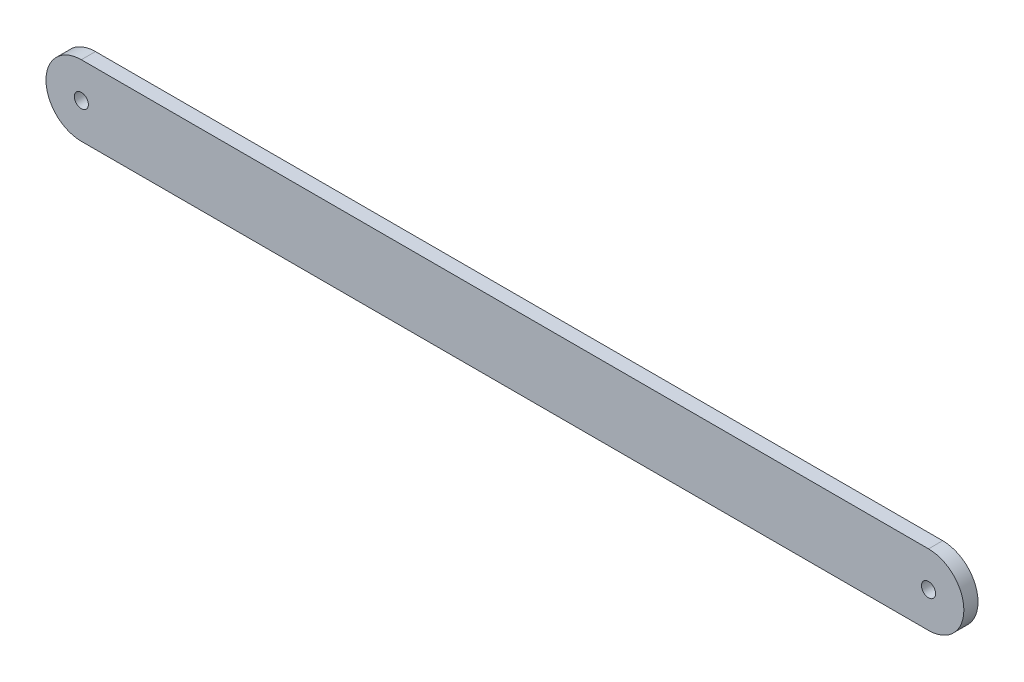
ISO-10303-21;
HEADER;
FILE_DESCRIPTION(('STEP AP214'),'2;1');
FILE_NAME('part.step','',(''),(''),'','','');
FILE_SCHEMA(('AUTOMOTIVE_DESIGN { 1 0 10303 214 1 1 1 1 }'));
ENDSEC;
DATA;
#1=APPLICATION_CONTEXT('core data for automotive mechanical design processes');
#2=APPLICATION_PROTOCOL_DEFINITION('international standard','automotive_design',2000,#1);
#3=PRODUCT_CONTEXT('',#1,'mechanical');
#4=PRODUCT('Part','Part','',(#3));
#5=PRODUCT_RELATED_PRODUCT_CATEGORY('part','',(#4));
#6=PRODUCT_DEFINITION_FORMATION('','',#4);
#7=PRODUCT_DEFINITION_CONTEXT('part definition',#1,'design');
#8=PRODUCT_DEFINITION('design','',#6,#7);
#9=PRODUCT_DEFINITION_SHAPE('','',#8);
#10=(LENGTH_UNIT() NAMED_UNIT(*) SI_UNIT(.MILLI.,.METRE.));
#11=(NAMED_UNIT(*) PLANE_ANGLE_UNIT() SI_UNIT($,.RADIAN.));
#12=(NAMED_UNIT(*) SI_UNIT($,.STERADIAN.) SOLID_ANGLE_UNIT());
#13=UNCERTAINTY_MEASURE_WITH_UNIT(LENGTH_MEASURE(1.E-05),#10,'distance_accuracy_value','');
#14=(GEOMETRIC_REPRESENTATION_CONTEXT(3) GLOBAL_UNCERTAINTY_ASSIGNED_CONTEXT((#13)) GLOBAL_UNIT_ASSIGNED_CONTEXT((#10,
#11,#12)) REPRESENTATION_CONTEXT('',''));
#15=CARTESIAN_POINT('',(0.,0.,0.));
#16=DIRECTION('',(0.,0.,1.));
#17=DIRECTION('',(1.,0.,0.));
#18=AXIS2_PLACEMENT_3D('',#15,#16,#17);
#19=CARTESIAN_POINT('',(-120.000000000065,3.83026943495679E-12,4.));
#20=DIRECTION('',(0.,0.,1.));
#21=DIRECTION('',(1.,0.,0.));
#22=AXIS2_PLACEMENT_3D('',#19,#20,#21);
#23=PLANE('',#22);
#24=CARTESIAN_POINT('',(-120.000000000065,3.83026943495679E-12,4.));
#25=DIRECTION('',(0.,0.,1.));
#26=DIRECTION('',(1.,0.,0.));
#27=AXIS2_PLACEMENT_3D('',#24,#25,#26);
#28=CIRCLE('',#27,2.00000000006351);
#29=CARTESIAN_POINT('',(-118.000000000001,3.83026943495679E-12,4.));
#30=VERTEX_POINT('',#29);
#31=EDGE_CURVE('E102',#30,#30,#28,.T.);
#32=ORIENTED_EDGE('',*,*,#31,.F.);
#33=EDGE_LOOP('',(#32));
#34=FACE_BOUND('',#33,.T.);
#35=CARTESIAN_POINT('',(-120.000000000065,3.83026943495679E-12,4.));
#36=DIRECTION('',(0.,0.,1.));
#37=DIRECTION('',(1.,0.,0.));
#38=AXIS2_PLACEMENT_3D('',#35,#36,#37);
#39=CIRCLE('',#38,10.);
#40=CARTESIAN_POINT('',(-120.000000000089,10.0000000000038,4.));
#41=VERTEX_POINT('',#40);
#42=CARTESIAN_POINT('',(-120.00000000004,-9.99999999999618,4.));
#43=VERTEX_POINT('',#42);
#44=EDGE_CURVE('E87',#41,#43,#39,.T.);
#45=ORIENTED_EDGE('',*,*,#44,.T.);
#46=DIRECTION('',(1.,0.,0.));
#47=VECTOR('',#46,1.);
#48=CARTESIAN_POINT('',(119.75999999996,-9.99999999999616,4.));
#49=LINE('',#48,#47);
#50=CARTESIAN_POINT('',(119.75999999996,-9.99999999999616,4.));
#51=VERTEX_POINT('',#50);
#52=EDGE_CURVE('E82',#43,#51,#49,.T.);
#53=ORIENTED_EDGE('',*,*,#52,.T.);
#54=CARTESIAN_POINT('',(119.75999999996,3.84241249928863E-12,4.));
#55=DIRECTION('',(0.,0.,1.));
#56=DIRECTION('',(1.,0.,0.));
#57=AXIS2_PLACEMENT_3D('',#54,#55,#56);
#58=CIRCLE('',#57,10.);
#59=CARTESIAN_POINT('',(119.75999999996,10.0000000000038,4.));
#60=VERTEX_POINT('',#59);
#61=EDGE_CURVE('E85',#51,#60,#58,.T.);
#62=ORIENTED_EDGE('',*,*,#61,.T.);
#63=DIRECTION('',(-1.,0.,0.));
#64=VECTOR('',#63,1.);
#65=CARTESIAN_POINT('',(119.75999999996,10.0000000000038,4.));
#66=LINE('',#65,#64);
#67=EDGE_CURVE('E52',#60,#41,#66,.T.);
#68=ORIENTED_EDGE('',*,*,#67,.T.);
#69=EDGE_LOOP('',(#45,#53,#62,#68));
#70=FACE_BOUND('',#69,.T.);
#71=CARTESIAN_POINT('',(119.75999999996,3.84241249928863E-12,4.));
#72=DIRECTION('',(0.,0.,1.));
#73=DIRECTION('',(1.,0.,0.));
#74=AXIS2_PLACEMENT_3D('',#71,#72,#73);
#75=CIRCLE('',#74,2.);
#76=CARTESIAN_POINT('',(121.75999999996,3.84241249928863E-12,4.));
#77=VERTEX_POINT('',#76);
#78=EDGE_CURVE('E117',#77,#77,#75,.T.);
#79=ORIENTED_EDGE('',*,*,#78,.F.);
#80=EDGE_LOOP('',(#79));
#81=FACE_BOUND('',#80,.T.);
#82=ADVANCED_FACE('F35',(#34,#70,#81),#23,.T.);
#83=CARTESIAN_POINT('',(-120.000000000065,3.83026943495679E-12,0.));
#84=DIRECTION('',(0.,0.,1.));
#85=DIRECTION('',(1.,0.,0.));
#86=AXIS2_PLACEMENT_3D('',#83,#84,#85);
#87=PLANE('',#86);
#88=CARTESIAN_POINT('',(-120.000000000065,3.83026943495679E-12,0.));
#89=DIRECTION('',(0.,0.,1.));
#90=DIRECTION('',(1.,0.,0.));
#91=AXIS2_PLACEMENT_3D('',#88,#89,#90);
#92=CIRCLE('',#91,10.);
#93=CARTESIAN_POINT('',(-120.000000000089,10.0000000000038,0.));
#94=VERTEX_POINT('',#93);
#95=CARTESIAN_POINT('',(-120.00000000004,-9.99999999999618,0.));
#96=VERTEX_POINT('',#95);
#97=EDGE_CURVE('E99',#94,#96,#92,.T.);
#98=ORIENTED_EDGE('',*,*,#97,.F.);
#99=DIRECTION('',(-1.,0.,0.));
#100=VECTOR('',#99,1.);
#101=CARTESIAN_POINT('',(119.75999999996,10.0000000000038,0.));
#102=LINE('',#101,#100);
#103=CARTESIAN_POINT('',(119.75999999996,10.0000000000038,0.));
#104=VERTEX_POINT('',#103);
#105=EDGE_CURVE('E75',#104,#94,#102,.T.);
#106=ORIENTED_EDGE('',*,*,#105,.F.);
#107=CARTESIAN_POINT('',(119.75999999996,3.84241249928863E-12,0.));
#108=DIRECTION('',(0.,0.,1.));
#109=DIRECTION('',(1.,0.,0.));
#110=AXIS2_PLACEMENT_3D('',#107,#108,#109);
#111=CIRCLE('',#110,10.);
#112=CARTESIAN_POINT('',(119.75999999996,-9.99999999999616,0.));
#113=VERTEX_POINT('',#112);
#114=EDGE_CURVE('E69',#113,#104,#111,.T.);
#115=ORIENTED_EDGE('',*,*,#114,.F.);
#116=DIRECTION('',(1.,0.,0.));
#117=VECTOR('',#116,1.);
#118=CARTESIAN_POINT('',(119.75999999996,-9.99999999999616,0.));
#119=LINE('',#118,#117);
#120=EDGE_CURVE('E91',#96,#113,#119,.T.);
#121=ORIENTED_EDGE('',*,*,#120,.F.);
#122=EDGE_LOOP('',(#98,#106,#115,#121));
#123=FACE_BOUND('',#122,.T.);
#124=CARTESIAN_POINT('',(-120.000000000065,3.83026943495679E-12,0.));
#125=DIRECTION('',(0.,0.,1.));
#126=DIRECTION('',(1.,0.,0.));
#127=AXIS2_PLACEMENT_3D('',#124,#125,#126);
#128=CIRCLE('',#127,2.00000000006351);
#129=CARTESIAN_POINT('',(-118.000000000001,3.83026943495679E-12,0.));
#130=VERTEX_POINT('',#129);
#131=EDGE_CURVE('E114',#130,#130,#128,.T.);
#132=ORIENTED_EDGE('',*,*,#131,.T.);
#133=EDGE_LOOP('',(#132));
#134=FACE_BOUND('',#133,.T.);
#135=CARTESIAN_POINT('',(119.75999999996,3.84241249928863E-12,0.));
#136=DIRECTION('',(0.,0.,1.));
#137=DIRECTION('',(1.,0.,0.));
#138=AXIS2_PLACEMENT_3D('',#135,#136,#137);
#139=CIRCLE('',#138,2.);
#140=CARTESIAN_POINT('',(121.75999999996,3.84241249928863E-12,0.));
#141=VERTEX_POINT('',#140);
#142=EDGE_CURVE('E120',#141,#141,#139,.T.);
#143=ORIENTED_EDGE('',*,*,#142,.T.);
#144=EDGE_LOOP('',(#143));
#145=FACE_BOUND('',#144,.T.);
#146=ADVANCED_FACE('F110',(#123,#134,#145),#87,.F.);
#147=CARTESIAN_POINT('',(-120.000000000065,3.83026943495679E-12,4.));
#148=DIRECTION('',(0.,0.,-1.));
#149=DIRECTION('',(-1.,0.,0.));
#150=AXIS2_PLACEMENT_3D('',#147,#148,#149);
#151=CYLINDRICAL_SURFACE('',#150,10.);
#152=ORIENTED_EDGE('',*,*,#97,.T.);
#153=DIRECTION('',(0.,0.,-1.));
#154=VECTOR('',#153,1.);
#155=CARTESIAN_POINT('',(-120.00000000004,-9.99999999999618,4.));
#156=LINE('',#155,#154);
#157=EDGE_CURVE('E11',#43,#96,#156,.T.);
#158=ORIENTED_EDGE('',*,*,#157,.F.);
#159=ORIENTED_EDGE('',*,*,#44,.F.);
#160=DIRECTION('',(0.,0.,-1.));
#161=VECTOR('',#160,1.);
#162=CARTESIAN_POINT('',(-120.000000000089,10.0000000000038,4.));
#163=LINE('',#162,#161);
#164=EDGE_CURVE('E95',#41,#94,#163,.T.);
#165=ORIENTED_EDGE('',*,*,#164,.T.);
#166=EDGE_LOOP('',(#152,#158,#159,#165));
#167=FACE_BOUND('',#166,.T.);
#168=ADVANCED_FACE('F37',(#167),#151,.T.);
#169=CARTESIAN_POINT('',(119.75999999996,-9.99999999999616,4.));
#170=DIRECTION('',(0.,1.,0.));
#171=DIRECTION('',(-1.,0.,0.));
#172=AXIS2_PLACEMENT_3D('',#169,#170,#171);
#173=PLANE('',#172);
#174=ORIENTED_EDGE('',*,*,#120,.T.);
#175=DIRECTION('',(0.,0.,-1.));
#176=VECTOR('',#175,1.);
#177=CARTESIAN_POINT('',(119.75999999996,-9.99999999999616,4.));
#178=LINE('',#177,#176);
#179=EDGE_CURVE('E44',#51,#113,#178,.T.);
#180=ORIENTED_EDGE('',*,*,#179,.F.);
#181=ORIENTED_EDGE('',*,*,#52,.F.);
#182=ORIENTED_EDGE('',*,*,#157,.T.);
#183=EDGE_LOOP('',(#174,#180,#181,#182));
#184=FACE_BOUND('',#183,.T.);
#185=ADVANCED_FACE('F90',(#184),#173,.F.);
#186=CARTESIAN_POINT('',(119.75999999996,3.84241249928863E-12,4.));
#187=DIRECTION('',(0.,0.,-1.));
#188=DIRECTION('',(-1.,0.,0.));
#189=AXIS2_PLACEMENT_3D('',#186,#187,#188);
#190=CYLINDRICAL_SURFACE('',#189,10.);
#191=ORIENTED_EDGE('',*,*,#114,.T.);
#192=DIRECTION('',(0.,0.,-1.));
#193=VECTOR('',#192,1.);
#194=CARTESIAN_POINT('',(119.75999999996,10.0000000000038,4.));
#195=LINE('',#194,#193);
#196=EDGE_CURVE('E92',#60,#104,#195,.T.);
#197=ORIENTED_EDGE('',*,*,#196,.F.);
#198=ORIENTED_EDGE('',*,*,#61,.F.);
#199=ORIENTED_EDGE('',*,*,#179,.T.);
#200=EDGE_LOOP('',(#191,#197,#198,#199));
#201=FACE_BOUND('',#200,.T.);
#202=ADVANCED_FACE('F93',(#201),#190,.T.);
#203=CARTESIAN_POINT('',(119.75999999996,10.0000000000038,4.));
#204=DIRECTION('',(0.,-1.,0.));
#205=DIRECTION('',(1.,0.,0.));
#206=AXIS2_PLACEMENT_3D('',#203,#204,#205);
#207=PLANE('',#206);
#208=ORIENTED_EDGE('',*,*,#105,.T.);
#209=ORIENTED_EDGE('',*,*,#164,.F.);
#210=ORIENTED_EDGE('',*,*,#67,.F.);
#211=ORIENTED_EDGE('',*,*,#196,.T.);
#212=EDGE_LOOP('',(#208,#209,#210,#211));
#213=FACE_BOUND('',#212,.T.);
#214=ADVANCED_FACE('F107',(#213),#207,.F.);
#215=CARTESIAN_POINT('',(-120.000000000065,3.83026943495679E-12,4.));
#216=DIRECTION('',(0.,0.,-1.));
#217=DIRECTION('',(-1.,0.,0.));
#218=AXIS2_PLACEMENT_3D('',#215,#216,#217);
#219=CYLINDRICAL_SURFACE('',#218,2.00000000006351);
#220=ORIENTED_EDGE('',*,*,#31,.T.);
#221=EDGE_LOOP('',(#220));
#222=FACE_BOUND('',#221,.T.);
#223=ORIENTED_EDGE('',*,*,#131,.F.);
#224=EDGE_LOOP('',(#223));
#225=FACE_BOUND('',#224,.T.);
#226=ADVANCED_FACE('F137',(#222,#225),#219,.F.);
#227=CARTESIAN_POINT('',(119.75999999996,3.84241249928863E-12,4.));
#228=DIRECTION('',(0.,0.,-1.));
#229=DIRECTION('',(-1.,0.,0.));
#230=AXIS2_PLACEMENT_3D('',#227,#228,#229);
#231=CYLINDRICAL_SURFACE('',#230,2.);
#232=ORIENTED_EDGE('',*,*,#78,.T.);
#233=EDGE_LOOP('',(#232));
#234=FACE_BOUND('',#233,.T.);
#235=ORIENTED_EDGE('',*,*,#142,.F.);
#236=EDGE_LOOP('',(#235));
#237=FACE_BOUND('',#236,.T.);
#238=ADVANCED_FACE('F126',(#234,#237),#231,.F.);
#239=CLOSED_SHELL('',(#82,#146,#168,#185,#202,#214,#226,#238));
#240=MANIFOLD_SOLID_BREP('B2',#239);
#241=ADVANCED_BREP_SHAPE_REPRESENTATION('',(#18,#240),#14);
#242=SHAPE_DEFINITION_REPRESENTATION(#9,#241);
ENDSEC;
END-ISO-10303-21;
